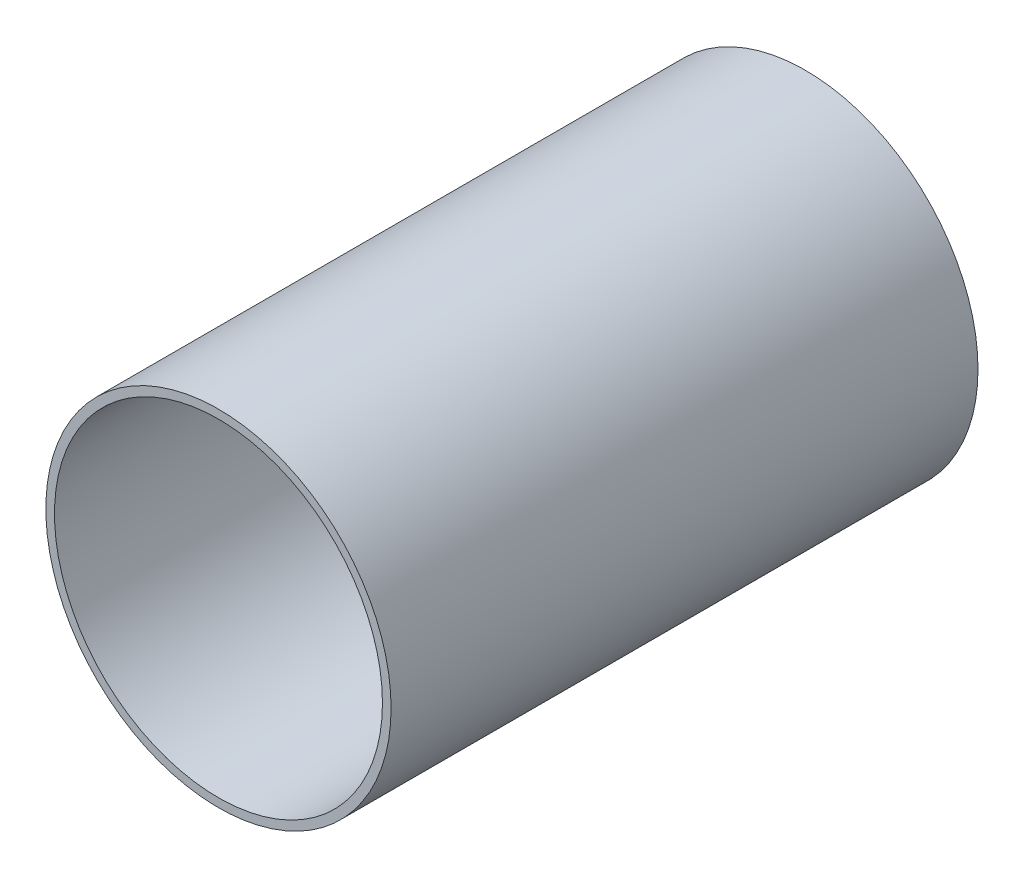
ISO-10303-21;
HEADER;
FILE_DESCRIPTION(('STEP AP214'),'2;1');
FILE_NAME('part.step','',(''),(''),'','','');
FILE_SCHEMA(('AUTOMOTIVE_DESIGN { 1 0 10303 214 1 1 1 1 }'));
ENDSEC;
DATA;
#1=APPLICATION_CONTEXT('core data for automotive mechanical design processes');
#2=APPLICATION_PROTOCOL_DEFINITION('international standard','automotive_design',2000,#1);
#3=PRODUCT_CONTEXT('',#1,'mechanical');
#4=PRODUCT('Part','Part','',(#3));
#5=PRODUCT_RELATED_PRODUCT_CATEGORY('part','',(#4));
#6=PRODUCT_DEFINITION_FORMATION('','',#4);
#7=PRODUCT_DEFINITION_CONTEXT('part definition',#1,'design');
#8=PRODUCT_DEFINITION('design','',#6,#7);
#9=PRODUCT_DEFINITION_SHAPE('','',#8);
#10=(LENGTH_UNIT() NAMED_UNIT(*) SI_UNIT(.MILLI.,.METRE.));
#11=(NAMED_UNIT(*) PLANE_ANGLE_UNIT() SI_UNIT($,.RADIAN.));
#12=(NAMED_UNIT(*) SI_UNIT($,.STERADIAN.) SOLID_ANGLE_UNIT());
#13=UNCERTAINTY_MEASURE_WITH_UNIT(LENGTH_MEASURE(1.E-05),#10,'distance_accuracy_value','');
#14=(GEOMETRIC_REPRESENTATION_CONTEXT(3) GLOBAL_UNCERTAINTY_ASSIGNED_CONTEXT((#13)) GLOBAL_UNIT_ASSIGNED_CONTEXT((#10,
#11,#12)) REPRESENTATION_CONTEXT('',''));
#15=CARTESIAN_POINT('',(0.,0.,0.));
#16=DIRECTION('',(0.,0.,1.));
#17=DIRECTION('',(1.,0.,0.));
#18=AXIS2_PLACEMENT_3D('',#15,#16,#17);
#19=CARTESIAN_POINT('',(0.,0.,107.95));
#20=DIRECTION('',(0.,0.,1.));
#21=DIRECTION('',(1.,0.,0.));
#22=AXIS2_PLACEMENT_3D('',#19,#20,#21);
#23=PLANE('',#22);
#24=CARTESIAN_POINT('',(0.,0.,107.95));
#25=DIRECTION('',(0.,0.,1.));
#26=DIRECTION('',(1.,0.,0.));
#27=AXIS2_PLACEMENT_3D('',#24,#25,#26);
#28=CIRCLE('',#27,63.5);
#29=CARTESIAN_POINT('',(63.5,0.,107.95));
#30=VERTEX_POINT('',#29);
#31=EDGE_CURVE('E10',#30,#30,#28,.T.);
#32=ORIENTED_EDGE('',*,*,#31,.T.);
#33=EDGE_LOOP('',(#32));
#34=FACE_BOUND('',#33,.T.);
#35=CARTESIAN_POINT('',(0.,0.,107.95));
#36=DIRECTION('',(0.,0.,1.));
#37=DIRECTION('',(1.,0.,0.));
#38=AXIS2_PLACEMENT_3D('',#35,#36,#37);
#39=CIRCLE('',#38,60.325);
#40=CARTESIAN_POINT('',(60.325,0.,107.95));
#41=VERTEX_POINT('',#40);
#42=EDGE_CURVE('E44',#41,#41,#39,.T.);
#43=ORIENTED_EDGE('',*,*,#42,.F.);
#44=EDGE_LOOP('',(#43));
#45=FACE_BOUND('',#44,.T.);
#46=ADVANCED_FACE('F33',(#34,#45),#23,.T.);
#47=CARTESIAN_POINT('',(0.,0.,-107.95));
#48=DIRECTION('',(0.,0.,1.));
#49=DIRECTION('',(1.,0.,0.));
#50=AXIS2_PLACEMENT_3D('',#47,#48,#49);
#51=PLANE('',#50);
#52=CARTESIAN_POINT('',(0.,0.,-107.95));
#53=DIRECTION('',(0.,0.,1.));
#54=DIRECTION('',(1.,0.,0.));
#55=AXIS2_PLACEMENT_3D('',#52,#53,#54);
#56=CIRCLE('',#55,63.5);
#57=CARTESIAN_POINT('',(63.5,0.,-107.95));
#58=VERTEX_POINT('',#57);
#59=EDGE_CURVE('E37',#58,#58,#56,.T.);
#60=ORIENTED_EDGE('',*,*,#59,.F.);
#61=EDGE_LOOP('',(#60));
#62=FACE_BOUND('',#61,.T.);
#63=CARTESIAN_POINT('',(0.,0.,-107.95));
#64=DIRECTION('',(0.,0.,1.));
#65=DIRECTION('',(1.,0.,0.));
#66=AXIS2_PLACEMENT_3D('',#63,#64,#65);
#67=CIRCLE('',#66,60.325);
#68=CARTESIAN_POINT('',(60.325,0.,-107.95));
#69=VERTEX_POINT('',#68);
#70=EDGE_CURVE('E46',#69,#69,#67,.T.);
#71=ORIENTED_EDGE('',*,*,#70,.T.);
#72=EDGE_LOOP('',(#71));
#73=FACE_BOUND('',#72,.T.);
#74=ADVANCED_FACE('F56',(#62,#73),#51,.F.);
#75=CARTESIAN_POINT('',(0.,0.,107.95));
#76=DIRECTION('',(0.,0.,-1.));
#77=DIRECTION('',(-1.,0.,0.));
#78=AXIS2_PLACEMENT_3D('',#75,#76,#77);
#79=CYLINDRICAL_SURFACE('',#78,63.5);
#80=ORIENTED_EDGE('',*,*,#31,.F.);
#81=EDGE_LOOP('',(#80));
#82=FACE_BOUND('',#81,.T.);
#83=ORIENTED_EDGE('',*,*,#59,.T.);
#84=EDGE_LOOP('',(#83));
#85=FACE_BOUND('',#84,.T.);
#86=ADVANCED_FACE('F35',(#82,#85),#79,.T.);
#87=CARTESIAN_POINT('',(0.,0.,107.95));
#88=DIRECTION('',(0.,0.,-1.));
#89=DIRECTION('',(-1.,0.,0.));
#90=AXIS2_PLACEMENT_3D('',#87,#88,#89);
#91=CYLINDRICAL_SURFACE('',#90,60.325);
#92=ORIENTED_EDGE('',*,*,#42,.T.);
#93=EDGE_LOOP('',(#92));
#94=FACE_BOUND('',#93,.T.);
#95=ORIENTED_EDGE('',*,*,#70,.F.);
#96=EDGE_LOOP('',(#95));
#97=FACE_BOUND('',#96,.T.);
#98=ADVANCED_FACE('F52',(#94,#97),#91,.F.);
#99=CLOSED_SHELL('',(#46,#74,#86,#98));
#100=MANIFOLD_SOLID_BREP('B2',#99);
#101=ADVANCED_BREP_SHAPE_REPRESENTATION('',(#18,#100),#14);
#102=SHAPE_DEFINITION_REPRESENTATION(#9,#101);
ENDSEC;
END-ISO-10303-21;
